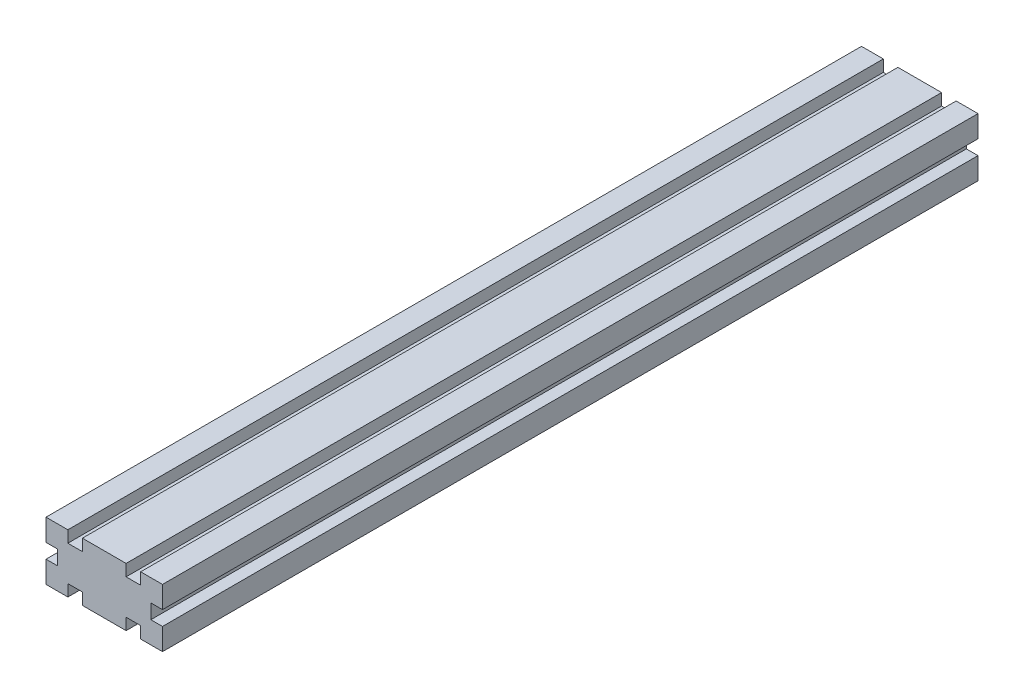
ISO-10303-21;
HEADER;
FILE_DESCRIPTION(('STEP AP214'),'2;1');
FILE_NAME('part.step','',(''),(''),'','','');
FILE_SCHEMA(('AUTOMOTIVE_DESIGN { 1 0 10303 214 1 1 1 1 }'));
ENDSEC;
DATA;
#1=APPLICATION_CONTEXT('core data for automotive mechanical design processes');
#2=APPLICATION_PROTOCOL_DEFINITION('international standard','automotive_design',2000,#1);
#3=PRODUCT_CONTEXT('',#1,'mechanical');
#4=PRODUCT('Part','Part','',(#3));
#5=PRODUCT_RELATED_PRODUCT_CATEGORY('part','',(#4));
#6=PRODUCT_DEFINITION_FORMATION('','',#4);
#7=PRODUCT_DEFINITION_CONTEXT('part definition',#1,'design');
#8=PRODUCT_DEFINITION('design','',#6,#7);
#9=PRODUCT_DEFINITION_SHAPE('','',#8);
#10=(LENGTH_UNIT() NAMED_UNIT(*) SI_UNIT(.MILLI.,.METRE.));
#11=(NAMED_UNIT(*) PLANE_ANGLE_UNIT() SI_UNIT($,.RADIAN.));
#12=(NAMED_UNIT(*) SI_UNIT($,.STERADIAN.) SOLID_ANGLE_UNIT());
#13=UNCERTAINTY_MEASURE_WITH_UNIT(LENGTH_MEASURE(1.E-05),#10,'distance_accuracy_value','');
#14=(GEOMETRIC_REPRESENTATION_CONTEXT(3) GLOBAL_UNCERTAINTY_ASSIGNED_CONTEXT((#13)) GLOBAL_UNIT_ASSIGNED_CONTEXT((#10,
#11,#12)) REPRESENTATION_CONTEXT('',''));
#15=CARTESIAN_POINT('',(0.,0.,0.));
#16=DIRECTION('',(0.,0.,1.));
#17=DIRECTION('',(1.,0.,0.));
#18=AXIS2_PLACEMENT_3D('',#15,#16,#17);
#19=CARTESIAN_POINT('',(40.,0.,280.));
#20=DIRECTION('',(-1.,0.,0.));
#21=DIRECTION('',(0.,0.,1.));
#22=AXIS2_PLACEMENT_3D('',#19,#20,#21);
#23=PLANE('',#22);
#24=DIRECTION('',(0.,1.,0.));
#25=VECTOR('',#24,1.);
#26=CARTESIAN_POINT('',(40.,0.,0.));
#27=LINE('',#26,#25);
#28=CARTESIAN_POINT('',(40.,12.5,0.));
#29=VERTEX_POINT('',#28);
#30=CARTESIAN_POINT('',(40.,20.,0.));
#31=VERTEX_POINT('',#30);
#32=EDGE_CURVE('E257',#29,#31,#27,.T.);
#33=ORIENTED_EDGE('',*,*,#32,.T.);
#34=DIRECTION('',(0.,0.,-1.));
#35=VECTOR('',#34,1.);
#36=CARTESIAN_POINT('',(40.,20.,280.));
#37=LINE('',#36,#35);
#38=CARTESIAN_POINT('',(40.,20.,280.));
#39=VERTEX_POINT('',#38);
#40=EDGE_CURVE('E11',#39,#31,#37,.T.);
#41=ORIENTED_EDGE('',*,*,#40,.F.);
#42=DIRECTION('',(0.,1.,0.));
#43=VECTOR('',#42,1.);
#44=CARTESIAN_POINT('',(40.,0.,280.));
#45=LINE('',#44,#43);
#46=CARTESIAN_POINT('',(40.,12.5,280.));
#47=VERTEX_POINT('',#46);
#48=EDGE_CURVE('E156',#47,#39,#45,.T.);
#49=ORIENTED_EDGE('',*,*,#48,.F.);
#50=DIRECTION('',(0.,0.,-1.));
#51=VECTOR('',#50,1.);
#52=CARTESIAN_POINT('',(40.,12.5,280.));
#53=LINE('',#52,#51);
#54=EDGE_CURVE('E256',#47,#29,#53,.T.);
#55=ORIENTED_EDGE('',*,*,#54,.T.);
#56=EDGE_LOOP('',(#33,#41,#49,#55));
#57=FACE_BOUND('',#56,.T.);
#58=ADVANCED_FACE('F41',(#57),#23,.F.);
#59=CARTESIAN_POINT('',(0.,20.,280.));
#60=DIRECTION('',(0.,1.,0.));
#61=DIRECTION('',(0.,0.,1.));
#62=AXIS2_PLACEMENT_3D('',#59,#60,#61);
#63=PLANE('',#62);
#64=DIRECTION('',(1.,0.,0.));
#65=VECTOR('',#64,1.);
#66=CARTESIAN_POINT('',(0.,20.,0.));
#67=LINE('',#66,#65);
#68=CARTESIAN_POINT('',(32.5,20.,0.));
#69=VERTEX_POINT('',#68);
#70=EDGE_CURVE('E260',#69,#31,#67,.T.);
#71=ORIENTED_EDGE('',*,*,#70,.F.);
#72=DIRECTION('',(0.,0.,-1.));
#73=VECTOR('',#72,1.);
#74=CARTESIAN_POINT('',(32.5,20.,280.));
#75=LINE('',#74,#73);
#76=CARTESIAN_POINT('',(32.5,20.,280.));
#77=VERTEX_POINT('',#76);
#78=EDGE_CURVE('E49',#77,#69,#75,.T.);
#79=ORIENTED_EDGE('',*,*,#78,.F.);
#80=DIRECTION('',(1.,0.,0.));
#81=VECTOR('',#80,1.);
#82=CARTESIAN_POINT('',(0.,20.,280.));
#83=LINE('',#82,#81);
#84=EDGE_CURVE('E402',#77,#39,#83,.T.);
#85=ORIENTED_EDGE('',*,*,#84,.T.);
#86=ORIENTED_EDGE('',*,*,#40,.T.);
#87=EDGE_LOOP('',(#71,#79,#85,#86));
#88=FACE_BOUND('',#87,.T.);
#89=ADVANCED_FACE('F390',(#88),#63,.T.);
#90=CARTESIAN_POINT('',(32.5,0.,280.));
#91=DIRECTION('',(-1.,0.,0.));
#92=DIRECTION('',(0.,0.,1.));
#93=AXIS2_PLACEMENT_3D('',#90,#91,#92);
#94=PLANE('',#93);
#95=DIRECTION('',(0.,1.,0.));
#96=VECTOR('',#95,1.);
#97=CARTESIAN_POINT('',(32.5,0.,0.));
#98=LINE('',#97,#96);
#99=CARTESIAN_POINT('',(32.5,16.,0.));
#100=VERTEX_POINT('',#99);
#101=EDGE_CURVE('E263',#100,#69,#98,.T.);
#102=ORIENTED_EDGE('',*,*,#101,.F.);
#103=DIRECTION('',(0.,0.,-1.));
#104=VECTOR('',#103,1.);
#105=CARTESIAN_POINT('',(32.5,16.,280.));
#106=LINE('',#105,#104);
#107=CARTESIAN_POINT('',(32.5,16.,280.));
#108=VERTEX_POINT('',#107);
#109=EDGE_CURVE('E380',#108,#100,#106,.T.);
#110=ORIENTED_EDGE('',*,*,#109,.F.);
#111=DIRECTION('',(0.,1.,0.));
#112=VECTOR('',#111,1.);
#113=CARTESIAN_POINT('',(32.5,0.,280.));
#114=LINE('',#113,#112);
#115=EDGE_CURVE('E387',#108,#77,#114,.T.);
#116=ORIENTED_EDGE('',*,*,#115,.T.);
#117=ORIENTED_EDGE('',*,*,#78,.T.);
#118=EDGE_LOOP('',(#102,#110,#116,#117));
#119=FACE_BOUND('',#118,.T.);
#120=ADVANCED_FACE('F385',(#119),#94,.T.);
#121=CARTESIAN_POINT('',(0.,16.,280.));
#122=DIRECTION('',(0.,1.,0.));
#123=DIRECTION('',(0.,0.,1.));
#124=AXIS2_PLACEMENT_3D('',#121,#122,#123);
#125=PLANE('',#124);
#126=DIRECTION('',(1.,0.,0.));
#127=VECTOR('',#126,1.);
#128=CARTESIAN_POINT('',(0.,16.,0.));
#129=LINE('',#128,#127);
#130=CARTESIAN_POINT('',(27.5,16.,0.));
#131=VERTEX_POINT('',#130);
#132=EDGE_CURVE('E266',#131,#100,#129,.T.);
#133=ORIENTED_EDGE('',*,*,#132,.F.);
#134=DIRECTION('',(0.,0.,-1.));
#135=VECTOR('',#134,1.);
#136=CARTESIAN_POINT('',(27.5,16.,280.));
#137=LINE('',#136,#135);
#138=CARTESIAN_POINT('',(27.5,16.,280.));
#139=VERTEX_POINT('',#138);
#140=EDGE_CURVE('E378',#139,#131,#137,.T.);
#141=ORIENTED_EDGE('',*,*,#140,.F.);
#142=DIRECTION('',(1.,0.,0.));
#143=VECTOR('',#142,1.);
#144=CARTESIAN_POINT('',(0.,16.,280.));
#145=LINE('',#144,#143);
#146=EDGE_CURVE('E401',#139,#108,#145,.T.);
#147=ORIENTED_EDGE('',*,*,#146,.T.);
#148=ORIENTED_EDGE('',*,*,#109,.T.);
#149=EDGE_LOOP('',(#133,#141,#147,#148));
#150=FACE_BOUND('',#149,.T.);
#151=ADVANCED_FACE('F397',(#150),#125,.T.);
#152=CARTESIAN_POINT('',(27.5,0.,280.));
#153=DIRECTION('',(-1.,0.,0.));
#154=DIRECTION('',(0.,0.,1.));
#155=AXIS2_PLACEMENT_3D('',#152,#153,#154);
#156=PLANE('',#155);
#157=DIRECTION('',(0.,1.,0.));
#158=VECTOR('',#157,1.);
#159=CARTESIAN_POINT('',(27.5,0.,0.));
#160=LINE('',#159,#158);
#161=CARTESIAN_POINT('',(27.5,20.,0.));
#162=VERTEX_POINT('',#161);
#163=EDGE_CURVE('E269',#131,#162,#160,.T.);
#164=ORIENTED_EDGE('',*,*,#163,.T.);
#165=DIRECTION('',(0.,0.,-1.));
#166=VECTOR('',#165,1.);
#167=CARTESIAN_POINT('',(27.5,20.,280.));
#168=LINE('',#167,#166);
#169=CARTESIAN_POINT('',(27.5,20.,280.));
#170=VERTEX_POINT('',#169);
#171=EDGE_CURVE('E376',#170,#162,#168,.T.);
#172=ORIENTED_EDGE('',*,*,#171,.F.);
#173=DIRECTION('',(0.,1.,0.));
#174=VECTOR('',#173,1.);
#175=CARTESIAN_POINT('',(27.5,0.,280.));
#176=LINE('',#175,#174);
#177=EDGE_CURVE('E404',#139,#170,#176,.T.);
#178=ORIENTED_EDGE('',*,*,#177,.F.);
#179=ORIENTED_EDGE('',*,*,#140,.T.);
#180=EDGE_LOOP('',(#164,#172,#178,#179));
#181=FACE_BOUND('',#180,.T.);
#182=ADVANCED_FACE('F486',(#181),#156,.F.);
#183=CARTESIAN_POINT('',(0.,20.,280.));
#184=DIRECTION('',(0.,1.,0.));
#185=DIRECTION('',(0.,0.,1.));
#186=AXIS2_PLACEMENT_3D('',#183,#184,#185);
#187=PLANE('',#186);
#188=DIRECTION('',(1.,0.,0.));
#189=VECTOR('',#188,1.);
#190=CARTESIAN_POINT('',(0.,20.,0.));
#191=LINE('',#190,#189);
#192=CARTESIAN_POINT('',(12.5,20.,0.));
#193=VERTEX_POINT('',#192);
#194=EDGE_CURVE('E272',#193,#162,#191,.T.);
#195=ORIENTED_EDGE('',*,*,#194,.F.);
#196=DIRECTION('',(0.,0.,-1.));
#197=VECTOR('',#196,1.);
#198=CARTESIAN_POINT('',(12.5,20.,280.));
#199=LINE('',#198,#197);
#200=CARTESIAN_POINT('',(12.5,20.,280.));
#201=VERTEX_POINT('',#200);
#202=EDGE_CURVE('E374',#201,#193,#199,.T.);
#203=ORIENTED_EDGE('',*,*,#202,.F.);
#204=DIRECTION('',(1.,0.,0.));
#205=VECTOR('',#204,1.);
#206=CARTESIAN_POINT('',(0.,20.,280.));
#207=LINE('',#206,#205);
#208=EDGE_CURVE('E410',#201,#170,#207,.T.);
#209=ORIENTED_EDGE('',*,*,#208,.T.);
#210=ORIENTED_EDGE('',*,*,#171,.T.);
#211=EDGE_LOOP('',(#195,#203,#209,#210));
#212=FACE_BOUND('',#211,.T.);
#213=ADVANCED_FACE('F489',(#212),#187,.T.);
#214=CARTESIAN_POINT('',(12.5,0.,280.));
#215=DIRECTION('',(-1.,0.,0.));
#216=DIRECTION('',(0.,0.,1.));
#217=AXIS2_PLACEMENT_3D('',#214,#215,#216);
#218=PLANE('',#217);
#219=DIRECTION('',(0.,1.,0.));
#220=VECTOR('',#219,1.);
#221=CARTESIAN_POINT('',(12.5,0.,0.));
#222=LINE('',#221,#220);
#223=CARTESIAN_POINT('',(12.5,16.,0.));
#224=VERTEX_POINT('',#223);
#225=EDGE_CURVE('E275',#224,#193,#222,.T.);
#226=ORIENTED_EDGE('',*,*,#225,.F.);
#227=DIRECTION('',(0.,0.,-1.));
#228=VECTOR('',#227,1.);
#229=CARTESIAN_POINT('',(12.5,16.,280.));
#230=LINE('',#229,#228);
#231=CARTESIAN_POINT('',(12.5,16.,280.));
#232=VERTEX_POINT('',#231);
#233=EDGE_CURVE('E372',#232,#224,#230,.T.);
#234=ORIENTED_EDGE('',*,*,#233,.F.);
#235=DIRECTION('',(0.,1.,0.));
#236=VECTOR('',#235,1.);
#237=CARTESIAN_POINT('',(12.5,0.,280.));
#238=LINE('',#237,#236);
#239=EDGE_CURVE('E413',#232,#201,#238,.T.);
#240=ORIENTED_EDGE('',*,*,#239,.T.);
#241=ORIENTED_EDGE('',*,*,#202,.T.);
#242=EDGE_LOOP('',(#226,#234,#240,#241));
#243=FACE_BOUND('',#242,.T.);
#244=ADVANCED_FACE('F493',(#243),#218,.T.);
#245=CARTESIAN_POINT('',(0.,16.,280.));
#246=DIRECTION('',(0.,1.,0.));
#247=DIRECTION('',(0.,0.,1.));
#248=AXIS2_PLACEMENT_3D('',#245,#246,#247);
#249=PLANE('',#248);
#250=DIRECTION('',(1.,0.,0.));
#251=VECTOR('',#250,1.);
#252=CARTESIAN_POINT('',(0.,16.,0.));
#253=LINE('',#252,#251);
#254=CARTESIAN_POINT('',(7.5,16.,0.));
#255=VERTEX_POINT('',#254);
#256=EDGE_CURVE('E278',#255,#224,#253,.T.);
#257=ORIENTED_EDGE('',*,*,#256,.F.);
#258=DIRECTION('',(0.,0.,-1.));
#259=VECTOR('',#258,1.);
#260=CARTESIAN_POINT('',(7.5,16.,280.));
#261=LINE('',#260,#259);
#262=CARTESIAN_POINT('',(7.5,16.,280.));
#263=VERTEX_POINT('',#262);
#264=EDGE_CURVE('E370',#263,#255,#261,.T.);
#265=ORIENTED_EDGE('',*,*,#264,.F.);
#266=DIRECTION('',(1.,0.,0.));
#267=VECTOR('',#266,1.);
#268=CARTESIAN_POINT('',(0.,16.,280.));
#269=LINE('',#268,#267);
#270=EDGE_CURVE('E416',#263,#232,#269,.T.);
#271=ORIENTED_EDGE('',*,*,#270,.T.);
#272=ORIENTED_EDGE('',*,*,#233,.T.);
#273=EDGE_LOOP('',(#257,#265,#271,#272));
#274=FACE_BOUND('',#273,.T.);
#275=ADVANCED_FACE('F497',(#274),#249,.T.);
#276=CARTESIAN_POINT('',(7.5,0.,280.));
#277=DIRECTION('',(-1.,0.,0.));
#278=DIRECTION('',(0.,0.,1.));
#279=AXIS2_PLACEMENT_3D('',#276,#277,#278);
#280=PLANE('',#279);
#281=DIRECTION('',(0.,1.,0.));
#282=VECTOR('',#281,1.);
#283=CARTESIAN_POINT('',(7.5,0.,0.));
#284=LINE('',#283,#282);
#285=CARTESIAN_POINT('',(7.5,20.,0.));
#286=VERTEX_POINT('',#285);
#287=EDGE_CURVE('E281',#255,#286,#284,.T.);
#288=ORIENTED_EDGE('',*,*,#287,.T.);
#289=DIRECTION('',(0.,0.,-1.));
#290=VECTOR('',#289,1.);
#291=CARTESIAN_POINT('',(7.5,20.,280.));
#292=LINE('',#291,#290);
#293=CARTESIAN_POINT('',(7.5,20.,280.));
#294=VERTEX_POINT('',#293);
#295=EDGE_CURVE('E368',#294,#286,#292,.T.);
#296=ORIENTED_EDGE('',*,*,#295,.F.);
#297=DIRECTION('',(0.,1.,0.));
#298=VECTOR('',#297,1.);
#299=CARTESIAN_POINT('',(7.5,0.,280.));
#300=LINE('',#299,#298);
#301=EDGE_CURVE('E419',#263,#294,#300,.T.);
#302=ORIENTED_EDGE('',*,*,#301,.F.);
#303=ORIENTED_EDGE('',*,*,#264,.T.);
#304=EDGE_LOOP('',(#288,#296,#302,#303));
#305=FACE_BOUND('',#304,.T.);
#306=ADVANCED_FACE('F501',(#305),#280,.F.);
#307=CARTESIAN_POINT('',(0.,20.,280.));
#308=DIRECTION('',(0.,1.,0.));
#309=DIRECTION('',(0.,0.,1.));
#310=AXIS2_PLACEMENT_3D('',#307,#308,#309);
#311=PLANE('',#310);
#312=DIRECTION('',(1.,0.,0.));
#313=VECTOR('',#312,1.);
#314=CARTESIAN_POINT('',(0.,20.,0.));
#315=LINE('',#314,#313);
#316=CARTESIAN_POINT('',(0.,20.,0.));
#317=VERTEX_POINT('',#316);
#318=EDGE_CURVE('E284',#317,#286,#315,.T.);
#319=ORIENTED_EDGE('',*,*,#318,.F.);
#320=DIRECTION('',(0.,0.,-1.));
#321=VECTOR('',#320,1.);
#322=CARTESIAN_POINT('',(0.,20.,280.));
#323=LINE('',#322,#321);
#324=CARTESIAN_POINT('',(0.,20.,280.));
#325=VERTEX_POINT('',#324);
#326=EDGE_CURVE('E366',#325,#317,#323,.T.);
#327=ORIENTED_EDGE('',*,*,#326,.F.);
#328=DIRECTION('',(1.,0.,0.));
#329=VECTOR('',#328,1.);
#330=CARTESIAN_POINT('',(0.,20.,280.));
#331=LINE('',#330,#329);
#332=EDGE_CURVE('E421',#325,#294,#331,.T.);
#333=ORIENTED_EDGE('',*,*,#332,.T.);
#334=ORIENTED_EDGE('',*,*,#295,.T.);
#335=EDGE_LOOP('',(#319,#327,#333,#334));
#336=FACE_BOUND('',#335,.T.);
#337=ADVANCED_FACE('F505',(#336),#311,.T.);
#338=CARTESIAN_POINT('',(0.,0.,280.));
#339=DIRECTION('',(-1.,0.,0.));
#340=DIRECTION('',(0.,0.,1.));
#341=AXIS2_PLACEMENT_3D('',#338,#339,#340);
#342=PLANE('',#341);
#343=DIRECTION('',(0.,1.,0.));
#344=VECTOR('',#343,1.);
#345=CARTESIAN_POINT('',(0.,0.,0.));
#346=LINE('',#345,#344);
#347=CARTESIAN_POINT('',(0.,12.5,0.));
#348=VERTEX_POINT('',#347);
#349=EDGE_CURVE('E287',#348,#317,#346,.T.);
#350=ORIENTED_EDGE('',*,*,#349,.F.);
#351=DIRECTION('',(0.,0.,-1.));
#352=VECTOR('',#351,1.);
#353=CARTESIAN_POINT('',(0.,12.5,280.));
#354=LINE('',#353,#352);
#355=CARTESIAN_POINT('',(0.,12.5,280.));
#356=VERTEX_POINT('',#355);
#357=EDGE_CURVE('E364',#356,#348,#354,.T.);
#358=ORIENTED_EDGE('',*,*,#357,.F.);
#359=DIRECTION('',(0.,1.,0.));
#360=VECTOR('',#359,1.);
#361=CARTESIAN_POINT('',(0.,0.,280.));
#362=LINE('',#361,#360);
#363=EDGE_CURVE('E424',#356,#325,#362,.T.);
#364=ORIENTED_EDGE('',*,*,#363,.T.);
#365=ORIENTED_EDGE('',*,*,#326,.T.);
#366=EDGE_LOOP('',(#350,#358,#364,#365));
#367=FACE_BOUND('',#366,.T.);
#368=ADVANCED_FACE('F509',(#367),#342,.T.);
#369=CARTESIAN_POINT('',(0.,12.5,280.));
#370=DIRECTION('',(0.,1.,0.));
#371=DIRECTION('',(-1.,0.,0.));
#372=AXIS2_PLACEMENT_3D('',#369,#370,#371);
#373=PLANE('',#372);
#374=DIRECTION('',(1.,0.,0.));
#375=VECTOR('',#374,1.);
#376=CARTESIAN_POINT('',(0.,12.5,0.));
#377=LINE('',#376,#375);
#378=CARTESIAN_POINT('',(4.,12.5,0.));
#379=VERTEX_POINT('',#378);
#380=EDGE_CURVE('E290',#348,#379,#377,.T.);
#381=ORIENTED_EDGE('',*,*,#380,.T.);
#382=DIRECTION('',(0.,0.,-1.));
#383=VECTOR('',#382,1.);
#384=CARTESIAN_POINT('',(4.,12.5,280.));
#385=LINE('',#384,#383);
#386=CARTESIAN_POINT('',(4.,12.5,280.));
#387=VERTEX_POINT('',#386);
#388=EDGE_CURVE('E362',#387,#379,#385,.T.);
#389=ORIENTED_EDGE('',*,*,#388,.F.);
#390=DIRECTION('',(1.,0.,0.));
#391=VECTOR('',#390,1.);
#392=CARTESIAN_POINT('',(0.,12.5,280.));
#393=LINE('',#392,#391);
#394=EDGE_CURVE('E427',#356,#387,#393,.T.);
#395=ORIENTED_EDGE('',*,*,#394,.F.);
#396=ORIENTED_EDGE('',*,*,#357,.T.);
#397=EDGE_LOOP('',(#381,#389,#395,#396));
#398=FACE_BOUND('',#397,.T.);
#399=ADVANCED_FACE('F513',(#398),#373,.F.);
#400=CARTESIAN_POINT('',(4.,0.,280.));
#401=DIRECTION('',(-1.,0.,0.));
#402=DIRECTION('',(0.,0.,1.));
#403=AXIS2_PLACEMENT_3D('',#400,#401,#402);
#404=PLANE('',#403);
#405=DIRECTION('',(0.,1.,0.));
#406=VECTOR('',#405,1.);
#407=CARTESIAN_POINT('',(4.,0.,0.));
#408=LINE('',#407,#406);
#409=CARTESIAN_POINT('',(4.,7.5,0.));
#410=VERTEX_POINT('',#409);
#411=EDGE_CURVE('E293',#410,#379,#408,.T.);
#412=ORIENTED_EDGE('',*,*,#411,.F.);
#413=DIRECTION('',(0.,0.,-1.));
#414=VECTOR('',#413,1.);
#415=CARTESIAN_POINT('',(4.,7.5,280.));
#416=LINE('',#415,#414);
#417=CARTESIAN_POINT('',(4.,7.5,280.));
#418=VERTEX_POINT('',#417);
#419=EDGE_CURVE('E360',#418,#410,#416,.T.);
#420=ORIENTED_EDGE('',*,*,#419,.F.);
#421=DIRECTION('',(0.,1.,0.));
#422=VECTOR('',#421,1.);
#423=CARTESIAN_POINT('',(4.,0.,280.));
#424=LINE('',#423,#422);
#425=EDGE_CURVE('E429',#418,#387,#424,.T.);
#426=ORIENTED_EDGE('',*,*,#425,.T.);
#427=ORIENTED_EDGE('',*,*,#388,.T.);
#428=EDGE_LOOP('',(#412,#420,#426,#427));
#429=FACE_BOUND('',#428,.T.);
#430=ADVANCED_FACE('F517',(#429),#404,.T.);
#431=CARTESIAN_POINT('',(0.,7.5,280.));
#432=DIRECTION('',(0.,1.,0.));
#433=DIRECTION('',(-1.,0.,0.));
#434=AXIS2_PLACEMENT_3D('',#431,#432,#433);
#435=PLANE('',#434);
#436=DIRECTION('',(1.,0.,0.));
#437=VECTOR('',#436,1.);
#438=CARTESIAN_POINT('',(0.,7.5,0.));
#439=LINE('',#438,#437);
#440=CARTESIAN_POINT('',(0.,7.5,0.));
#441=VERTEX_POINT('',#440);
#442=EDGE_CURVE('E296',#441,#410,#439,.T.);
#443=ORIENTED_EDGE('',*,*,#442,.F.);
#444=DIRECTION('',(0.,0.,-1.));
#445=VECTOR('',#444,1.);
#446=CARTESIAN_POINT('',(0.,7.5,280.));
#447=LINE('',#446,#445);
#448=CARTESIAN_POINT('',(0.,7.5,280.));
#449=VERTEX_POINT('',#448);
#450=EDGE_CURVE('E358',#449,#441,#447,.T.);
#451=ORIENTED_EDGE('',*,*,#450,.F.);
#452=DIRECTION('',(1.,0.,0.));
#453=VECTOR('',#452,1.);
#454=CARTESIAN_POINT('',(0.,7.5,280.));
#455=LINE('',#454,#453);
#456=EDGE_CURVE('E432',#449,#418,#455,.T.);
#457=ORIENTED_EDGE('',*,*,#456,.T.);
#458=ORIENTED_EDGE('',*,*,#419,.T.);
#459=EDGE_LOOP('',(#443,#451,#457,#458));
#460=FACE_BOUND('',#459,.T.);
#461=ADVANCED_FACE('F521',(#460),#435,.T.);
#462=CARTESIAN_POINT('',(0.,0.,280.));
#463=DIRECTION('',(-1.,0.,0.));
#464=DIRECTION('',(0.,0.,1.));
#465=AXIS2_PLACEMENT_3D('',#462,#463,#464);
#466=PLANE('',#465);
#467=DIRECTION('',(0.,1.,0.));
#468=VECTOR('',#467,1.);
#469=CARTESIAN_POINT('',(0.,0.,0.));
#470=LINE('',#469,#468);
#471=CARTESIAN_POINT('',(0.,0.,0.));
#472=VERTEX_POINT('',#471);
#473=EDGE_CURVE('E299',#472,#441,#470,.T.);
#474=ORIENTED_EDGE('',*,*,#473,.F.);
#475=DIRECTION('',(0.,0.,-1.));
#476=VECTOR('',#475,1.);
#477=CARTESIAN_POINT('',(0.,0.,280.));
#478=LINE('',#477,#476);
#479=CARTESIAN_POINT('',(0.,0.,280.));
#480=VERTEX_POINT('',#479);
#481=EDGE_CURVE('E356',#480,#472,#478,.T.);
#482=ORIENTED_EDGE('',*,*,#481,.F.);
#483=DIRECTION('',(0.,1.,0.));
#484=VECTOR('',#483,1.);
#485=CARTESIAN_POINT('',(0.,0.,280.));
#486=LINE('',#485,#484);
#487=EDGE_CURVE('E435',#480,#449,#486,.T.);
#488=ORIENTED_EDGE('',*,*,#487,.T.);
#489=ORIENTED_EDGE('',*,*,#450,.T.);
#490=EDGE_LOOP('',(#474,#482,#488,#489));
#491=FACE_BOUND('',#490,.T.);
#492=ADVANCED_FACE('F525',(#491),#466,.T.);
#493=CARTESIAN_POINT('',(0.,0.,280.));
#494=DIRECTION('',(0.,1.,0.));
#495=DIRECTION('',(0.,0.,1.));
#496=AXIS2_PLACEMENT_3D('',#493,#494,#495);
#497=PLANE('',#496);
#498=DIRECTION('',(1.,0.,0.));
#499=VECTOR('',#498,1.);
#500=CARTESIAN_POINT('',(0.,0.,0.));
#501=LINE('',#500,#499);
#502=CARTESIAN_POINT('',(7.5,0.,0.));
#503=VERTEX_POINT('',#502);
#504=EDGE_CURVE('E302',#472,#503,#501,.T.);
#505=ORIENTED_EDGE('',*,*,#504,.T.);
#506=DIRECTION('',(0.,0.,-1.));
#507=VECTOR('',#506,1.);
#508=CARTESIAN_POINT('',(7.5,0.,280.));
#509=LINE('',#508,#507);
#510=CARTESIAN_POINT('',(7.5,0.,280.));
#511=VERTEX_POINT('',#510);
#512=EDGE_CURVE('E353',#511,#503,#509,.T.);
#513=ORIENTED_EDGE('',*,*,#512,.F.);
#514=DIRECTION('',(1.,0.,0.));
#515=VECTOR('',#514,1.);
#516=CARTESIAN_POINT('',(0.,0.,280.));
#517=LINE('',#516,#515);
#518=EDGE_CURVE('E438',#480,#511,#517,.T.);
#519=ORIENTED_EDGE('',*,*,#518,.F.);
#520=ORIENTED_EDGE('',*,*,#481,.T.);
#521=EDGE_LOOP('',(#505,#513,#519,#520));
#522=FACE_BOUND('',#521,.T.);
#523=ADVANCED_FACE('F529',(#522),#497,.F.);
#524=CARTESIAN_POINT('',(7.5,0.,280.));
#525=DIRECTION('',(-1.,0.,0.));
#526=DIRECTION('',(0.,0.,1.));
#527=AXIS2_PLACEMENT_3D('',#524,#525,#526);
#528=PLANE('',#527);
#529=DIRECTION('',(0.,1.,0.));
#530=VECTOR('',#529,1.);
#531=CARTESIAN_POINT('',(7.5,0.,0.));
#532=LINE('',#531,#530);
#533=CARTESIAN_POINT('',(7.5,4.,0.));
#534=VERTEX_POINT('',#533);
#535=EDGE_CURVE('E304',#503,#534,#532,.T.);
#536=ORIENTED_EDGE('',*,*,#535,.T.);
#537=DIRECTION('',(0.,0.,-1.));
#538=VECTOR('',#537,1.);
#539=CARTESIAN_POINT('',(7.5,4.,280.));
#540=LINE('',#539,#538);
#541=CARTESIAN_POINT('',(7.5,4.,280.));
#542=VERTEX_POINT('',#541);
#543=EDGE_CURVE('E350',#542,#534,#540,.T.);
#544=ORIENTED_EDGE('',*,*,#543,.F.);
#545=DIRECTION('',(0.,1.,0.));
#546=VECTOR('',#545,1.);
#547=CARTESIAN_POINT('',(7.5,0.,280.));
#548=LINE('',#547,#546);
#549=EDGE_CURVE('E440',#511,#542,#548,.T.);
#550=ORIENTED_EDGE('',*,*,#549,.F.);
#551=ORIENTED_EDGE('',*,*,#512,.T.);
#552=EDGE_LOOP('',(#536,#544,#550,#551));
#553=FACE_BOUND('',#552,.T.);
#554=ADVANCED_FACE('F533',(#553),#528,.F.);
#555=CARTESIAN_POINT('',(0.,4.,280.));
#556=DIRECTION('',(0.,1.,0.));
#557=DIRECTION('',(0.,0.,1.));
#558=AXIS2_PLACEMENT_3D('',#555,#556,#557);
#559=PLANE('',#558);
#560=DIRECTION('',(1.,0.,0.));
#561=VECTOR('',#560,1.);
#562=CARTESIAN_POINT('',(0.,4.,0.));
#563=LINE('',#562,#561);
#564=CARTESIAN_POINT('',(12.5,4.,0.));
#565=VERTEX_POINT('',#564);
#566=EDGE_CURVE('E306',#534,#565,#563,.T.);
#567=ORIENTED_EDGE('',*,*,#566,.T.);
#568=DIRECTION('',(0.,0.,-1.));
#569=VECTOR('',#568,1.);
#570=CARTESIAN_POINT('',(12.5,4.,280.));
#571=LINE('',#570,#569);
#572=CARTESIAN_POINT('',(12.5,4.,280.));
#573=VERTEX_POINT('',#572);
#574=EDGE_CURVE('E348',#573,#565,#571,.T.);
#575=ORIENTED_EDGE('',*,*,#574,.F.);
#576=DIRECTION('',(1.,0.,0.));
#577=VECTOR('',#576,1.);
#578=CARTESIAN_POINT('',(0.,4.,280.));
#579=LINE('',#578,#577);
#580=EDGE_CURVE('E442',#542,#573,#579,.T.);
#581=ORIENTED_EDGE('',*,*,#580,.F.);
#582=ORIENTED_EDGE('',*,*,#543,.T.);
#583=EDGE_LOOP('',(#567,#575,#581,#582));
#584=FACE_BOUND('',#583,.T.);
#585=ADVANCED_FACE('F537',(#584),#559,.F.);
#586=CARTESIAN_POINT('',(12.5,0.,280.));
#587=DIRECTION('',(-1.,0.,0.));
#588=DIRECTION('',(0.,0.,1.));
#589=AXIS2_PLACEMENT_3D('',#586,#587,#588);
#590=PLANE('',#589);
#591=DIRECTION('',(0.,1.,0.));
#592=VECTOR('',#591,1.);
#593=CARTESIAN_POINT('',(12.5,0.,0.));
#594=LINE('',#593,#592);
#595=CARTESIAN_POINT('',(12.5,0.,0.));
#596=VERTEX_POINT('',#595);
#597=EDGE_CURVE('E309',#596,#565,#594,.T.);
#598=ORIENTED_EDGE('',*,*,#597,.F.);
#599=DIRECTION('',(0.,0.,-1.));
#600=VECTOR('',#599,1.);
#601=CARTESIAN_POINT('',(12.5,0.,280.));
#602=LINE('',#601,#600);
#603=CARTESIAN_POINT('',(12.5,0.,280.));
#604=VERTEX_POINT('',#603);
#605=EDGE_CURVE('E346',#604,#596,#602,.T.);
#606=ORIENTED_EDGE('',*,*,#605,.F.);
#607=DIRECTION('',(0.,1.,0.));
#608=VECTOR('',#607,1.);
#609=CARTESIAN_POINT('',(12.5,0.,280.));
#610=LINE('',#609,#608);
#611=EDGE_CURVE('E444',#604,#573,#610,.T.);
#612=ORIENTED_EDGE('',*,*,#611,.T.);
#613=ORIENTED_EDGE('',*,*,#574,.T.);
#614=EDGE_LOOP('',(#598,#606,#612,#613));
#615=FACE_BOUND('',#614,.T.);
#616=ADVANCED_FACE('F541',(#615),#590,.T.);
#617=CARTESIAN_POINT('',(0.,0.,280.));
#618=DIRECTION('',(0.,1.,0.));
#619=DIRECTION('',(0.,0.,1.));
#620=AXIS2_PLACEMENT_3D('',#617,#618,#619);
#621=PLANE('',#620);
#622=DIRECTION('',(1.,0.,0.));
#623=VECTOR('',#622,1.);
#624=CARTESIAN_POINT('',(0.,0.,0.));
#625=LINE('',#624,#623);
#626=CARTESIAN_POINT('',(27.5,0.,0.));
#627=VERTEX_POINT('',#626);
#628=EDGE_CURVE('E312',#596,#627,#625,.T.);
#629=ORIENTED_EDGE('',*,*,#628,.T.);
#630=DIRECTION('',(0.,0.,-1.));
#631=VECTOR('',#630,1.);
#632=CARTESIAN_POINT('',(27.5,0.,280.));
#633=LINE('',#632,#631);
#634=CARTESIAN_POINT('',(27.5,0.,280.));
#635=VERTEX_POINT('',#634);
#636=EDGE_CURVE('E343',#635,#627,#633,.T.);
#637=ORIENTED_EDGE('',*,*,#636,.F.);
#638=DIRECTION('',(1.,0.,0.));
#639=VECTOR('',#638,1.);
#640=CARTESIAN_POINT('',(0.,0.,280.));
#641=LINE('',#640,#639);
#642=EDGE_CURVE('E447',#604,#635,#641,.T.);
#643=ORIENTED_EDGE('',*,*,#642,.F.);
#644=ORIENTED_EDGE('',*,*,#605,.T.);
#645=EDGE_LOOP('',(#629,#637,#643,#644));
#646=FACE_BOUND('',#645,.T.);
#647=ADVANCED_FACE('F545',(#646),#621,.F.);
#648=CARTESIAN_POINT('',(27.5,0.,280.));
#649=DIRECTION('',(-1.,0.,0.));
#650=DIRECTION('',(0.,0.,1.));
#651=AXIS2_PLACEMENT_3D('',#648,#649,#650);
#652=PLANE('',#651);
#653=DIRECTION('',(0.,1.,0.));
#654=VECTOR('',#653,1.);
#655=CARTESIAN_POINT('',(27.5,0.,0.));
#656=LINE('',#655,#654);
#657=CARTESIAN_POINT('',(27.5,3.99999999999999,0.));
#658=VERTEX_POINT('',#657);
#659=EDGE_CURVE('E314',#627,#658,#656,.T.);
#660=ORIENTED_EDGE('',*,*,#659,.T.);
#661=DIRECTION('',(0.,0.,-1.));
#662=VECTOR('',#661,1.);
#663=CARTESIAN_POINT('',(27.5,3.99999999999999,280.));
#664=LINE('',#663,#662);
#665=CARTESIAN_POINT('',(27.5,3.99999999999999,280.));
#666=VERTEX_POINT('',#665);
#667=EDGE_CURVE('E340',#666,#658,#664,.T.);
#668=ORIENTED_EDGE('',*,*,#667,.F.);
#669=DIRECTION('',(0.,1.,0.));
#670=VECTOR('',#669,1.);
#671=CARTESIAN_POINT('',(27.5,0.,280.));
#672=LINE('',#671,#670);
#673=EDGE_CURVE('E449',#635,#666,#672,.T.);
#674=ORIENTED_EDGE('',*,*,#673,.F.);
#675=ORIENTED_EDGE('',*,*,#636,.T.);
#676=EDGE_LOOP('',(#660,#668,#674,#675));
#677=FACE_BOUND('',#676,.T.);
#678=ADVANCED_FACE('F549',(#677),#652,.F.);
#679=CARTESIAN_POINT('',(0.,3.99999999999999,280.));
#680=DIRECTION('',(0.,1.,0.));
#681=DIRECTION('',(0.,0.,1.));
#682=AXIS2_PLACEMENT_3D('',#679,#680,#681);
#683=PLANE('',#682);
#684=DIRECTION('',(1.,0.,0.));
#685=VECTOR('',#684,1.);
#686=CARTESIAN_POINT('',(0.,3.99999999999999,0.));
#687=LINE('',#686,#685);
#688=CARTESIAN_POINT('',(32.5,3.99999999999999,0.));
#689=VERTEX_POINT('',#688);
#690=EDGE_CURVE('E316',#658,#689,#687,.T.);
#691=ORIENTED_EDGE('',*,*,#690,.T.);
#692=DIRECTION('',(0.,0.,-1.));
#693=VECTOR('',#692,1.);
#694=CARTESIAN_POINT('',(32.5,3.99999999999999,280.));
#695=LINE('',#694,#693);
#696=CARTESIAN_POINT('',(32.5,3.99999999999999,280.));
#697=VERTEX_POINT('',#696);
#698=EDGE_CURVE('E338',#697,#689,#695,.T.);
#699=ORIENTED_EDGE('',*,*,#698,.F.);
#700=DIRECTION('',(1.,0.,0.));
#701=VECTOR('',#700,1.);
#702=CARTESIAN_POINT('',(0.,3.99999999999999,280.));
#703=LINE('',#702,#701);
#704=EDGE_CURVE('E451',#666,#697,#703,.T.);
#705=ORIENTED_EDGE('',*,*,#704,.F.);
#706=ORIENTED_EDGE('',*,*,#667,.T.);
#707=EDGE_LOOP('',(#691,#699,#705,#706));
#708=FACE_BOUND('',#707,.T.);
#709=ADVANCED_FACE('F553',(#708),#683,.F.);
#710=CARTESIAN_POINT('',(32.5,0.,280.));
#711=DIRECTION('',(-1.,0.,0.));
#712=DIRECTION('',(0.,0.,1.));
#713=AXIS2_PLACEMENT_3D('',#710,#711,#712);
#714=PLANE('',#713);
#715=DIRECTION('',(0.,1.,0.));
#716=VECTOR('',#715,1.);
#717=CARTESIAN_POINT('',(32.5,0.,0.));
#718=LINE('',#717,#716);
#719=CARTESIAN_POINT('',(32.5,0.,0.));
#720=VERTEX_POINT('',#719);
#721=EDGE_CURVE('E319',#720,#689,#718,.T.);
#722=ORIENTED_EDGE('',*,*,#721,.F.);
#723=DIRECTION('',(0.,0.,-1.));
#724=VECTOR('',#723,1.);
#725=CARTESIAN_POINT('',(32.5,0.,280.));
#726=LINE('',#725,#724);
#727=CARTESIAN_POINT('',(32.5,0.,280.));
#728=VERTEX_POINT('',#727);
#729=EDGE_CURVE('E336',#728,#720,#726,.T.);
#730=ORIENTED_EDGE('',*,*,#729,.F.);
#731=DIRECTION('',(0.,1.,0.));
#732=VECTOR('',#731,1.);
#733=CARTESIAN_POINT('',(32.5,0.,280.));
#734=LINE('',#733,#732);
#735=EDGE_CURVE('E453',#728,#697,#734,.T.);
#736=ORIENTED_EDGE('',*,*,#735,.T.);
#737=ORIENTED_EDGE('',*,*,#698,.T.);
#738=EDGE_LOOP('',(#722,#730,#736,#737));
#739=FACE_BOUND('',#738,.T.);
#740=ADVANCED_FACE('F557',(#739),#714,.T.);
#741=CARTESIAN_POINT('',(0.,0.,280.));
#742=DIRECTION('',(0.,1.,0.));
#743=DIRECTION('',(0.,0.,1.));
#744=AXIS2_PLACEMENT_3D('',#741,#742,#743);
#745=PLANE('',#744);
#746=DIRECTION('',(1.,0.,0.));
#747=VECTOR('',#746,1.);
#748=CARTESIAN_POINT('',(0.,0.,0.));
#749=LINE('',#748,#747);
#750=CARTESIAN_POINT('',(40.,0.,0.));
#751=VERTEX_POINT('',#750);
#752=EDGE_CURVE('E322',#720,#751,#749,.T.);
#753=ORIENTED_EDGE('',*,*,#752,.T.);
#754=DIRECTION('',(0.,0.,-1.));
#755=VECTOR('',#754,1.);
#756=CARTESIAN_POINT('',(40.,0.,280.));
#757=LINE('',#756,#755);
#758=CARTESIAN_POINT('',(40.,0.,280.));
#759=VERTEX_POINT('',#758);
#760=EDGE_CURVE('E333',#759,#751,#757,.T.);
#761=ORIENTED_EDGE('',*,*,#760,.F.);
#762=DIRECTION('',(1.,0.,0.));
#763=VECTOR('',#762,1.);
#764=CARTESIAN_POINT('',(0.,0.,280.));
#765=LINE('',#764,#763);
#766=EDGE_CURVE('E251',#728,#759,#765,.T.);
#767=ORIENTED_EDGE('',*,*,#766,.F.);
#768=ORIENTED_EDGE('',*,*,#729,.T.);
#769=EDGE_LOOP('',(#753,#761,#767,#768));
#770=FACE_BOUND('',#769,.T.);
#771=ADVANCED_FACE('F459',(#770),#745,.F.);
#772=CARTESIAN_POINT('',(40.,0.,280.));
#773=DIRECTION('',(-1.,0.,0.));
#774=DIRECTION('',(0.,0.,1.));
#775=AXIS2_PLACEMENT_3D('',#772,#773,#774);
#776=PLANE('',#775);
#777=DIRECTION('',(0.,1.,0.));
#778=VECTOR('',#777,1.);
#779=CARTESIAN_POINT('',(40.,0.,0.));
#780=LINE('',#779,#778);
#781=CARTESIAN_POINT('',(40.,7.5,0.));
#782=VERTEX_POINT('',#781);
#783=EDGE_CURVE('E324',#751,#782,#780,.T.);
#784=ORIENTED_EDGE('',*,*,#783,.T.);
#785=DIRECTION('',(0.,0.,-1.));
#786=VECTOR('',#785,1.);
#787=CARTESIAN_POINT('',(40.,7.5,280.));
#788=LINE('',#787,#786);
#789=CARTESIAN_POINT('',(40.,7.5,280.));
#790=VERTEX_POINT('',#789);
#791=EDGE_CURVE('E240',#790,#782,#788,.T.);
#792=ORIENTED_EDGE('',*,*,#791,.F.);
#793=DIRECTION('',(0.,1.,0.));
#794=VECTOR('',#793,1.);
#795=CARTESIAN_POINT('',(40.,0.,280.));
#796=LINE('',#795,#794);
#797=EDGE_CURVE('E248',#759,#790,#796,.T.);
#798=ORIENTED_EDGE('',*,*,#797,.F.);
#799=ORIENTED_EDGE('',*,*,#760,.T.);
#800=EDGE_LOOP('',(#784,#792,#798,#799));
#801=FACE_BOUND('',#800,.T.);
#802=ADVANCED_FACE('F463',(#801),#776,.F.);
#803=CARTESIAN_POINT('',(0.,7.5,280.));
#804=DIRECTION('',(0.,1.,0.));
#805=DIRECTION('',(-1.,0.,0.));
#806=AXIS2_PLACEMENT_3D('',#803,#804,#805);
#807=PLANE('',#806);
#808=DIRECTION('',(1.,0.,0.));
#809=VECTOR('',#808,1.);
#810=CARTESIAN_POINT('',(0.,7.5,0.));
#811=LINE('',#810,#809);
#812=CARTESIAN_POINT('',(36.,7.5,0.));
#813=VERTEX_POINT('',#812);
#814=EDGE_CURVE('E239',#813,#782,#811,.T.);
#815=ORIENTED_EDGE('',*,*,#814,.F.);
#816=DIRECTION('',(0.,0.,-1.));
#817=VECTOR('',#816,1.);
#818=CARTESIAN_POINT('',(36.,7.5,280.));
#819=LINE('',#818,#817);
#820=CARTESIAN_POINT('',(36.,7.5,280.));
#821=VERTEX_POINT('',#820);
#822=EDGE_CURVE('E233',#821,#813,#819,.T.);
#823=ORIENTED_EDGE('',*,*,#822,.F.);
#824=DIRECTION('',(1.,0.,0.));
#825=VECTOR('',#824,1.);
#826=CARTESIAN_POINT('',(0.,7.5,280.));
#827=LINE('',#826,#825);
#828=EDGE_CURVE('E237',#821,#790,#827,.T.);
#829=ORIENTED_EDGE('',*,*,#828,.T.);
#830=ORIENTED_EDGE('',*,*,#791,.T.);
#831=EDGE_LOOP('',(#815,#823,#829,#830));
#832=FACE_BOUND('',#831,.T.);
#833=ADVANCED_FACE('F235',(#832),#807,.T.);
#834=CARTESIAN_POINT('',(36.,0.,280.));
#835=DIRECTION('',(-1.,0.,0.));
#836=DIRECTION('',(0.,0.,1.));
#837=AXIS2_PLACEMENT_3D('',#834,#835,#836);
#838=PLANE('',#837);
#839=DIRECTION('',(0.,1.,0.));
#840=VECTOR('',#839,1.);
#841=CARTESIAN_POINT('',(36.,0.,0.));
#842=LINE('',#841,#840);
#843=CARTESIAN_POINT('',(36.,12.5,0.));
#844=VERTEX_POINT('',#843);
#845=EDGE_CURVE('E144',#813,#844,#842,.T.);
#846=ORIENTED_EDGE('',*,*,#845,.T.);
#847=DIRECTION('',(0.,0.,-1.));
#848=VECTOR('',#847,1.);
#849=CARTESIAN_POINT('',(36.,12.5,280.));
#850=LINE('',#849,#848);
#851=CARTESIAN_POINT('',(36.,12.5,280.));
#852=VERTEX_POINT('',#851);
#853=EDGE_CURVE('E241',#852,#844,#850,.T.);
#854=ORIENTED_EDGE('',*,*,#853,.F.);
#855=DIRECTION('',(0.,1.,0.));
#856=VECTOR('',#855,1.);
#857=CARTESIAN_POINT('',(36.,0.,280.));
#858=LINE('',#857,#856);
#859=EDGE_CURVE('E243',#821,#852,#858,.T.);
#860=ORIENTED_EDGE('',*,*,#859,.F.);
#861=ORIENTED_EDGE('',*,*,#822,.T.);
#862=EDGE_LOOP('',(#846,#854,#860,#861));
#863=FACE_BOUND('',#862,.T.);
#864=ADVANCED_FACE('F244',(#863),#838,.F.);
#865=CARTESIAN_POINT('',(0.,12.5,280.));
#866=DIRECTION('',(0.,1.,0.));
#867=DIRECTION('',(-1.,0.,0.));
#868=AXIS2_PLACEMENT_3D('',#865,#866,#867);
#869=PLANE('',#868);
#870=DIRECTION('',(1.,0.,0.));
#871=VECTOR('',#870,1.);
#872=CARTESIAN_POINT('',(0.,12.5,0.));
#873=LINE('',#872,#871);
#874=EDGE_CURVE('E150',#844,#29,#873,.T.);
#875=ORIENTED_EDGE('',*,*,#874,.T.);
#876=ORIENTED_EDGE('',*,*,#54,.F.);
#877=DIRECTION('',(1.,0.,0.));
#878=VECTOR('',#877,1.);
#879=CARTESIAN_POINT('',(0.,12.5,280.));
#880=LINE('',#879,#878);
#881=EDGE_CURVE('E57',#852,#47,#880,.T.);
#882=ORIENTED_EDGE('',*,*,#881,.F.);
#883=ORIENTED_EDGE('',*,*,#853,.T.);
#884=EDGE_LOOP('',(#875,#876,#882,#883));
#885=FACE_BOUND('',#884,.T.);
#886=ADVANCED_FACE('F465',(#885),#869,.F.);
#887=CARTESIAN_POINT('',(0.,0.,280.));
#888=DIRECTION('',(0.,0.,1.));
#889=DIRECTION('',(1.,0.,0.));
#890=AXIS2_PLACEMENT_3D('',#887,#888,#889);
#891=PLANE('',#890);
#892=ORIENTED_EDGE('',*,*,#48,.T.);
#893=ORIENTED_EDGE('',*,*,#84,.F.);
#894=ORIENTED_EDGE('',*,*,#115,.F.);
#895=ORIENTED_EDGE('',*,*,#146,.F.);
#896=ORIENTED_EDGE('',*,*,#177,.T.);
#897=ORIENTED_EDGE('',*,*,#208,.F.);
#898=ORIENTED_EDGE('',*,*,#239,.F.);
#899=ORIENTED_EDGE('',*,*,#270,.F.);
#900=ORIENTED_EDGE('',*,*,#301,.T.);
#901=ORIENTED_EDGE('',*,*,#332,.F.);
#902=ORIENTED_EDGE('',*,*,#363,.F.);
#903=ORIENTED_EDGE('',*,*,#394,.T.);
#904=ORIENTED_EDGE('',*,*,#425,.F.);
#905=ORIENTED_EDGE('',*,*,#456,.F.);
#906=ORIENTED_EDGE('',*,*,#487,.F.);
#907=ORIENTED_EDGE('',*,*,#518,.T.);
#908=ORIENTED_EDGE('',*,*,#549,.T.);
#909=ORIENTED_EDGE('',*,*,#580,.T.);
#910=ORIENTED_EDGE('',*,*,#611,.F.);
#911=ORIENTED_EDGE('',*,*,#642,.T.);
#912=ORIENTED_EDGE('',*,*,#673,.T.);
#913=ORIENTED_EDGE('',*,*,#704,.T.);
#914=ORIENTED_EDGE('',*,*,#735,.F.);
#915=ORIENTED_EDGE('',*,*,#766,.T.);
#916=ORIENTED_EDGE('',*,*,#797,.T.);
#917=ORIENTED_EDGE('',*,*,#828,.F.);
#918=ORIENTED_EDGE('',*,*,#859,.T.);
#919=ORIENTED_EDGE('',*,*,#881,.T.);
#920=EDGE_LOOP('',(#892,#893,#894,#895,#896,#897,#898,#899,#900,#901,#902,#903,#904,#905,#906,
#907,#908,#909,#910,#911,#912,#913,#914,#915,#916,#917,#918,#919));
#921=FACE_BOUND('',#920,.T.);
#922=ADVANCED_FACE('F246',(#921),#891,.T.);
#923=CARTESIAN_POINT('',(0.,0.,0.));
#924=DIRECTION('',(0.,0.,1.));
#925=DIRECTION('',(1.,0.,0.));
#926=AXIS2_PLACEMENT_3D('',#923,#924,#925);
#927=PLANE('',#926);
#928=ORIENTED_EDGE('',*,*,#32,.F.);
#929=ORIENTED_EDGE('',*,*,#874,.F.);
#930=ORIENTED_EDGE('',*,*,#845,.F.);
#931=ORIENTED_EDGE('',*,*,#814,.T.);
#932=ORIENTED_EDGE('',*,*,#783,.F.);
#933=ORIENTED_EDGE('',*,*,#752,.F.);
#934=ORIENTED_EDGE('',*,*,#721,.T.);
#935=ORIENTED_EDGE('',*,*,#690,.F.);
#936=ORIENTED_EDGE('',*,*,#659,.F.);
#937=ORIENTED_EDGE('',*,*,#628,.F.);
#938=ORIENTED_EDGE('',*,*,#597,.T.);
#939=ORIENTED_EDGE('',*,*,#566,.F.);
#940=ORIENTED_EDGE('',*,*,#535,.F.);
#941=ORIENTED_EDGE('',*,*,#504,.F.);
#942=ORIENTED_EDGE('',*,*,#473,.T.);
#943=ORIENTED_EDGE('',*,*,#442,.T.);
#944=ORIENTED_EDGE('',*,*,#411,.T.);
#945=ORIENTED_EDGE('',*,*,#380,.F.);
#946=ORIENTED_EDGE('',*,*,#349,.T.);
#947=ORIENTED_EDGE('',*,*,#318,.T.);
#948=ORIENTED_EDGE('',*,*,#287,.F.);
#949=ORIENTED_EDGE('',*,*,#256,.T.);
#950=ORIENTED_EDGE('',*,*,#225,.T.);
#951=ORIENTED_EDGE('',*,*,#194,.T.);
#952=ORIENTED_EDGE('',*,*,#163,.F.);
#953=ORIENTED_EDGE('',*,*,#132,.T.);
#954=ORIENTED_EDGE('',*,*,#101,.T.);
#955=ORIENTED_EDGE('',*,*,#70,.T.);
#956=EDGE_LOOP('',(#928,#929,#930,#931,#932,#933,#934,#935,#936,#937,#938,#939,#940,#941,#942,
#943,#944,#945,#946,#947,#948,#949,#950,#951,#952,#953,#954,#955));
#957=FACE_BOUND('',#956,.T.);
#958=ADVANCED_FACE('F393',(#957),#927,.F.);
#959=CLOSED_SHELL('',(#58,#89,#120,#151,#182,#213,#244,#275,#306,#337,#368,#399,#430,#461,#492,
#523,#554,#585,#616,#647,#678,#709,#740,#771,#802,#833,#864,#886,#922,#958));
#960=MANIFOLD_SOLID_BREP('B2',#959);
#961=ADVANCED_BREP_SHAPE_REPRESENTATION('',(#18,#960),#14);
#962=SHAPE_DEFINITION_REPRESENTATION(#9,#961);
ENDSEC;
END-ISO-10303-21;
